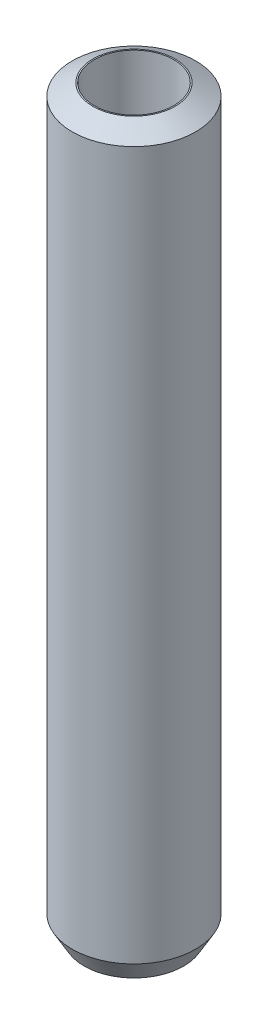
ISO-10303-21;
HEADER;
FILE_DESCRIPTION(('STEP AP214'),'2;1');
FILE_NAME('part.step','',(''),(''),'','','');
FILE_SCHEMA(('AUTOMOTIVE_DESIGN { 1 0 10303 214 1 1 1 1 }'));
ENDSEC;
DATA;
#1=APPLICATION_CONTEXT('core data for automotive mechanical design processes');
#2=APPLICATION_PROTOCOL_DEFINITION('international standard','automotive_design',2000,#1);
#3=PRODUCT_CONTEXT('',#1,'mechanical');
#4=PRODUCT('Part','Part','',(#3));
#5=PRODUCT_RELATED_PRODUCT_CATEGORY('part','',(#4));
#6=PRODUCT_DEFINITION_FORMATION('','',#4);
#7=PRODUCT_DEFINITION_CONTEXT('part definition',#1,'design');
#8=PRODUCT_DEFINITION('design','',#6,#7);
#9=PRODUCT_DEFINITION_SHAPE('','',#8);
#10=(LENGTH_UNIT() NAMED_UNIT(*) SI_UNIT(.MILLI.,.METRE.));
#11=(NAMED_UNIT(*) PLANE_ANGLE_UNIT() SI_UNIT($,.RADIAN.));
#12=(NAMED_UNIT(*) SI_UNIT($,.STERADIAN.) SOLID_ANGLE_UNIT());
#13=UNCERTAINTY_MEASURE_WITH_UNIT(LENGTH_MEASURE(1.E-05),#10,'distance_accuracy_value','');
#14=(GEOMETRIC_REPRESENTATION_CONTEXT(3) GLOBAL_UNCERTAINTY_ASSIGNED_CONTEXT((#13)) GLOBAL_UNIT_ASSIGNED_CONTEXT((#10,
#11,#12)) REPRESENTATION_CONTEXT('',''));
#15=CARTESIAN_POINT('',(0.,0.,0.));
#16=DIRECTION('',(0.,0.,1.));
#17=DIRECTION('',(1.,0.,0.));
#18=AXIS2_PLACEMENT_3D('',#15,#16,#17);
#19=CARTESIAN_POINT('',(0.,120.069179777452,0.));
#20=DIRECTION('',(0.,-1.,0.));
#21=DIRECTION('',(0.,0.,-1.));
#22=AXIS2_PLACEMENT_3D('',#19,#20,#21);
#23=CYLINDRICAL_SURFACE('',#22,10.);
#24=CARTESIAN_POINT('',(0.,118.146840284941,0.));
#25=DIRECTION('',(0.,1.,0.));
#26=DIRECTION('',(0.,0.,1.));
#27=AXIS2_PLACEMENT_3D('',#24,#25,#26);
#28=CIRCLE('',#27,10.);
#29=CARTESIAN_POINT('',(0.,118.146840284941,10.));
#30=VERTEX_POINT('',#29);
#31=EDGE_CURVE('E50',#30,#30,#28,.F.);
#32=ORIENTED_EDGE('',*,*,#31,.T.);
#33=EDGE_LOOP('',(#32));
#34=FACE_BOUND('',#33,.T.);
#35=CARTESIAN_POINT('',(0.,3.32958967042399,0.));
#36=DIRECTION('',(0.,1.,0.));
#37=DIRECTION('',(0.,0.,1.));
#38=AXIS2_PLACEMENT_3D('',#35,#36,#37);
#39=CIRCLE('',#38,10.);
#40=CARTESIAN_POINT('',(0.,3.32958967042399,10.));
#41=VERTEX_POINT('',#40);
#42=EDGE_CURVE('E51',#41,#41,#39,.T.);
#43=ORIENTED_EDGE('',*,*,#42,.T.);
#44=EDGE_LOOP('',(#43));
#45=FACE_BOUND('',#44,.T.);
#46=ADVANCED_FACE('F39',(#34,#45),#23,.T.);
#47=CARTESIAN_POINT('',(0.,120.069179777452,0.));
#48=DIRECTION('',(0.,1.,0.));
#49=DIRECTION('',(0.,0.,1.));
#50=AXIS2_PLACEMENT_3D('',#47,#48,#49);
#51=PLANE('',#50);
#52=CARTESIAN_POINT('',(0.,120.069179777452,0.));
#53=DIRECTION('',(0.,1.,0.));
#54=DIRECTION('',(0.,0.,1.));
#55=AXIS2_PLACEMENT_3D('',#52,#53,#54);
#56=CIRCLE('',#55,6.67041032957602);
#57=CARTESIAN_POINT('',(0.,120.069179777452,6.67041032957602));
#58=VERTEX_POINT('',#57);
#59=EDGE_CURVE('E54',#58,#58,#56,.T.);
#60=ORIENTED_EDGE('',*,*,#59,.T.);
#61=EDGE_LOOP('',(#60));
#62=FACE_BOUND('',#61,.T.);
#63=CARTESIAN_POINT('',(0.,120.069179777452,0.));
#64=DIRECTION('',(0.,1.,0.));
#65=DIRECTION('',(0.,0.,1.));
#66=AXIS2_PLACEMENT_3D('',#63,#64,#65);
#67=CIRCLE('',#66,6.46213369259115);
#68=CARTESIAN_POINT('',(0.,120.069179777452,6.46213369259115));
#69=VERTEX_POINT('',#68);
#70=EDGE_CURVE('E58',#69,#69,#67,.T.);
#71=ORIENTED_EDGE('',*,*,#70,.F.);
#72=EDGE_LOOP('',(#71));
#73=FACE_BOUND('',#72,.T.);
#74=ADVANCED_FACE('F69',(#62,#73),#51,.T.);
#75=CARTESIAN_POINT('',(0.,0.,0.));
#76=DIRECTION('',(0.,1.,0.));
#77=DIRECTION('',(0.,0.,1.));
#78=AXIS2_PLACEMENT_3D('',#75,#76,#77);
#79=PLANE('',#78);
#80=CARTESIAN_POINT('',(0.,0.,0.));
#81=DIRECTION('',(0.,1.,0.));
#82=DIRECTION('',(0.,0.,1.));
#83=AXIS2_PLACEMENT_3D('',#80,#81,#82);
#84=CIRCLE('',#83,8.07766050748969);
#85=CARTESIAN_POINT('',(0.,0.,8.07766050748969));
#86=VERTEX_POINT('',#85);
#87=EDGE_CURVE('E10',#86,#86,#84,.F.);
#88=ORIENTED_EDGE('',*,*,#87,.T.);
#89=EDGE_LOOP('',(#88));
#90=FACE_BOUND('',#89,.T.);
#91=CARTESIAN_POINT('',(0.,0.,0.));
#92=DIRECTION('',(0.,1.,0.));
#93=DIRECTION('',(0.,0.,1.));
#94=AXIS2_PLACEMENT_3D('',#91,#92,#93);
#95=CIRCLE('',#94,6.46213369259115);
#96=CARTESIAN_POINT('',(0.,0.,6.46213369259115));
#97=VERTEX_POINT('',#96);
#98=EDGE_CURVE('E63',#97,#97,#95,.T.);
#99=ORIENTED_EDGE('',*,*,#98,.T.);
#100=EDGE_LOOP('',(#99));
#101=FACE_BOUND('',#100,.T.);
#102=ADVANCED_FACE('F75',(#90,#101),#79,.F.);
#103=CARTESIAN_POINT('',(0.,120.069179777452,0.));
#104=DIRECTION('',(0.,-1.,0.));
#105=DIRECTION('',(0.,0.,-1.));
#106=AXIS2_PLACEMENT_3D('',#103,#104,#105);
#107=CYLINDRICAL_SURFACE('',#106,6.46213369259115);
#108=ORIENTED_EDGE('',*,*,#70,.T.);
#109=EDGE_LOOP('',(#108));
#110=FACE_BOUND('',#109,.T.);
#111=ORIENTED_EDGE('',*,*,#98,.F.);
#112=EDGE_LOOP('',(#111));
#113=FACE_BOUND('',#112,.T.);
#114=ADVANCED_FACE('F70',(#110,#113),#107,.F.);
#115=CARTESIAN_POINT('',(0.,120.069179777452,0.));
#116=DIRECTION('',(0.,-1.,0.));
#117=DIRECTION('',(0.,0.,-1.));
#118=AXIS2_PLACEMENT_3D('',#115,#116,#117);
#119=CONICAL_SURFACE('',#118,6.67041032957602,1.04719755119659);
#120=ORIENTED_EDGE('',*,*,#31,.F.);
#121=EDGE_LOOP('',(#120));
#122=FACE_BOUND('',#121,.T.);
#123=ORIENTED_EDGE('',*,*,#59,.F.);
#124=EDGE_LOOP('',(#123));
#125=FACE_BOUND('',#124,.T.);
#126=ADVANCED_FACE('F81',(#122,#125),#119,.T.);
#127=CARTESIAN_POINT('',(0.,3.32958967042399,0.));
#128=DIRECTION('',(0.,1.,0.));
#129=DIRECTION('',(0.,0.,1.));
#130=AXIS2_PLACEMENT_3D('',#127,#128,#129);
#131=CONICAL_SURFACE('',#130,10.,0.523598775598304);
#132=ORIENTED_EDGE('',*,*,#87,.F.);
#133=EDGE_LOOP('',(#132));
#134=FACE_BOUND('',#133,.T.);
#135=ORIENTED_EDGE('',*,*,#42,.F.);
#136=EDGE_LOOP('',(#135));
#137=FACE_BOUND('',#136,.T.);
#138=ADVANCED_FACE('F45',(#134,#137),#131,.T.);
#139=CLOSED_SHELL('',(#46,#74,#102,#114,#126,#138));
#140=MANIFOLD_SOLID_BREP('B2',#139);
#141=ADVANCED_BREP_SHAPE_REPRESENTATION('',(#18,#140),#14);
#142=SHAPE_DEFINITION_REPRESENTATION(#9,#141);
ENDSEC;
END-ISO-10303-21;
